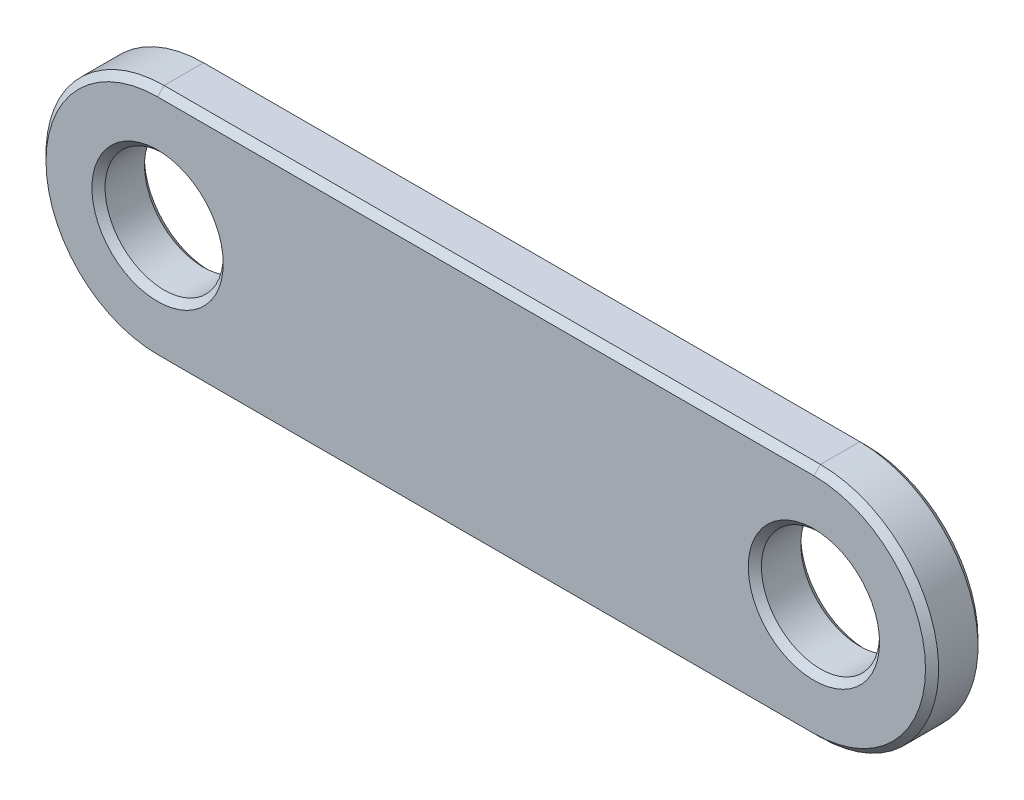
ISO-10303-21;
HEADER;
FILE_DESCRIPTION(('STEP AP214'),'2;1');
FILE_NAME('part.step','',(''),(''),'','','');
FILE_SCHEMA(('AUTOMOTIVE_DESIGN { 1 0 10303 214 1 1 1 1 }'));
ENDSEC;
DATA;
#1=APPLICATION_CONTEXT('core data for automotive mechanical design processes');
#2=APPLICATION_PROTOCOL_DEFINITION('international standard','automotive_design',2000,#1);
#3=PRODUCT_CONTEXT('',#1,'mechanical');
#4=PRODUCT('Part','Part','',(#3));
#5=PRODUCT_RELATED_PRODUCT_CATEGORY('part','',(#4));
#6=PRODUCT_DEFINITION_FORMATION('','',#4);
#7=PRODUCT_DEFINITION_CONTEXT('part definition',#1,'design');
#8=PRODUCT_DEFINITION('design','',#6,#7);
#9=PRODUCT_DEFINITION_SHAPE('','',#8);
#10=(LENGTH_UNIT() NAMED_UNIT(*) SI_UNIT(.MILLI.,.METRE.));
#11=(NAMED_UNIT(*) PLANE_ANGLE_UNIT() SI_UNIT($,.RADIAN.));
#12=(NAMED_UNIT(*) SI_UNIT($,.STERADIAN.) SOLID_ANGLE_UNIT());
#13=UNCERTAINTY_MEASURE_WITH_UNIT(LENGTH_MEASURE(1.E-05),#10,'distance_accuracy_value','');
#14=(GEOMETRIC_REPRESENTATION_CONTEXT(3) GLOBAL_UNCERTAINTY_ASSIGNED_CONTEXT((#13)) GLOBAL_UNIT_ASSIGNED_CONTEXT((#10,
#11,#12)) REPRESENTATION_CONTEXT('',''));
#15=CARTESIAN_POINT('',(0.,0.,0.));
#16=DIRECTION('',(0.,0.,1.));
#17=DIRECTION('',(1.,0.,0.));
#18=AXIS2_PLACEMENT_3D('',#15,#16,#17);
#19=CARTESIAN_POINT('',(-63.5,0.,5.08));
#20=DIRECTION('',(0.,0.,1.));
#21=DIRECTION('',(1.,0.,0.));
#22=AXIS2_PLACEMENT_3D('',#19,#20,#21);
#23=PLANE('',#22);
#24=CARTESIAN_POINT('',(0.,0.,5.08));
#25=DIRECTION('',(0.,0.,1.));
#26=DIRECTION('',(1.,0.,0.));
#27=AXIS2_PLACEMENT_3D('',#24,#25,#26);
#28=CIRCLE('',#27,6.34999999999998);
#29=CARTESIAN_POINT('',(6.34999999999998,0.,5.08));
#30=VERTEX_POINT('',#29);
#31=EDGE_CURVE('E269',#30,#30,#28,.F.);
#32=ORIENTED_EDGE('',*,*,#31,.T.);
#33=EDGE_LOOP('',(#32));
#34=FACE_BOUND('',#33,.T.);
#35=CARTESIAN_POINT('',(-63.5,0.,5.08));
#36=DIRECTION('',(0.,0.,1.));
#37=DIRECTION('',(1.,0.,0.));
#38=AXIS2_PLACEMENT_3D('',#35,#36,#37);
#39=CIRCLE('',#38,6.34999999999998);
#40=CARTESIAN_POINT('',(-57.1500000000001,0.,5.08));
#41=VERTEX_POINT('',#40);
#42=EDGE_CURVE('E254',#41,#41,#39,.F.);
#43=ORIENTED_EDGE('',*,*,#42,.T.);
#44=EDGE_LOOP('',(#43));
#45=FACE_BOUND('',#44,.T.);
#46=CARTESIAN_POINT('',(0.,0.,5.08));
#47=DIRECTION('',(0.,0.,1.));
#48=DIRECTION('',(1.,0.,0.));
#49=AXIS2_PLACEMENT_3D('',#46,#47,#48);
#50=CIRCLE('',#49,10.795);
#51=CARTESIAN_POINT('',(0.,-10.7950000000002,5.08));
#52=VERTEX_POINT('',#51);
#53=CARTESIAN_POINT('',(0.,10.795,5.08));
#54=VERTEX_POINT('',#53);
#55=EDGE_CURVE('E26',#52,#54,#50,.T.);
#56=ORIENTED_EDGE('',*,*,#55,.T.);
#57=DIRECTION('',(-1.,0.,0.));
#58=VECTOR('',#57,1.);
#59=CARTESIAN_POINT('',(-63.5,10.795,5.07999999999998));
#60=LINE('',#59,#58);
#61=CARTESIAN_POINT('',(-63.5,10.795,5.07999999999998));
#62=VERTEX_POINT('',#61);
#63=EDGE_CURVE('E10',#54,#62,#60,.T.);
#64=ORIENTED_EDGE('',*,*,#63,.T.);
#65=CARTESIAN_POINT('',(-63.5,0.,5.08));
#66=DIRECTION('',(0.,0.,1.));
#67=DIRECTION('',(1.,0.,0.));
#68=AXIS2_PLACEMENT_3D('',#65,#66,#67);
#69=CIRCLE('',#68,10.795);
#70=CARTESIAN_POINT('',(-63.5,-10.7950000000001,5.07999999999999));
#71=VERTEX_POINT('',#70);
#72=EDGE_CURVE('E166',#62,#71,#69,.T.);
#73=ORIENTED_EDGE('',*,*,#72,.T.);
#74=DIRECTION('',(1.,0.,0.));
#75=VECTOR('',#74,1.);
#76=CARTESIAN_POINT('',(0.,-10.7950000000002,5.08));
#77=LINE('',#76,#75);
#78=EDGE_CURVE('E44',#71,#52,#77,.T.);
#79=ORIENTED_EDGE('',*,*,#78,.T.);
#80=EDGE_LOOP('',(#56,#64,#73,#79));
#81=FACE_BOUND('',#80,.T.);
#82=ADVANCED_FACE('F16',(#34,#45,#81),#23,.T.);
#83=CARTESIAN_POINT('',(-63.5000000000001,0.,0.));
#84=DIRECTION('',(0.,0.,1.));
#85=DIRECTION('',(1.,0.,0.));
#86=AXIS2_PLACEMENT_3D('',#83,#84,#85);
#87=PLANE('',#86);
#88=CARTESIAN_POINT('',(0.,0.,0.));
#89=DIRECTION('',(0.,0.,1.));
#90=DIRECTION('',(1.,0.,0.));
#91=AXIS2_PLACEMENT_3D('',#88,#89,#90);
#92=CIRCLE('',#91,6.35);
#93=CARTESIAN_POINT('',(6.35,0.,0.));
#94=VERTEX_POINT('',#93);
#95=EDGE_CURVE('E249',#94,#94,#92,.T.);
#96=ORIENTED_EDGE('',*,*,#95,.T.);
#97=EDGE_LOOP('',(#96));
#98=FACE_BOUND('',#97,.T.);
#99=CARTESIAN_POINT('',(-63.5000000000001,0.,0.));
#100=DIRECTION('',(0.,0.,1.));
#101=DIRECTION('',(1.,0.,0.));
#102=AXIS2_PLACEMENT_3D('',#99,#100,#101);
#103=CIRCLE('',#102,6.34999999999999);
#104=CARTESIAN_POINT('',(-57.1500000000001,0.,0.));
#105=VERTEX_POINT('',#104);
#106=EDGE_CURVE('E258',#105,#105,#103,.T.);
#107=ORIENTED_EDGE('',*,*,#106,.T.);
#108=EDGE_LOOP('',(#107));
#109=FACE_BOUND('',#108,.T.);
#110=CARTESIAN_POINT('',(0.,0.,0.));
#111=DIRECTION('',(0.,0.,1.));
#112=DIRECTION('',(1.,0.,0.));
#113=AXIS2_PLACEMENT_3D('',#110,#111,#112);
#114=CIRCLE('',#113,10.795);
#115=CARTESIAN_POINT('',(0.,10.7949999999999,0.));
#116=VERTEX_POINT('',#115);
#117=CARTESIAN_POINT('',(0.,-10.7950000000001,0.));
#118=VERTEX_POINT('',#117);
#119=EDGE_CURVE('E132',#116,#118,#114,.F.);
#120=ORIENTED_EDGE('',*,*,#119,.T.);
#121=DIRECTION('',(-1.,0.,0.));
#122=VECTOR('',#121,1.);
#123=CARTESIAN_POINT('',(-63.5,-10.7950000000001,0.));
#124=LINE('',#123,#122);
#125=CARTESIAN_POINT('',(-63.5,-10.7950000000001,0.));
#126=VERTEX_POINT('',#125);
#127=EDGE_CURVE('E109',#118,#126,#124,.T.);
#128=ORIENTED_EDGE('',*,*,#127,.T.);
#129=CARTESIAN_POINT('',(-63.5000000000001,0.,0.));
#130=DIRECTION('',(0.,0.,1.));
#131=DIRECTION('',(1.,0.,0.));
#132=AXIS2_PLACEMENT_3D('',#129,#130,#131);
#133=CIRCLE('',#132,10.795);
#134=CARTESIAN_POINT('',(-63.5,10.795,0.));
#135=VERTEX_POINT('',#134);
#136=EDGE_CURVE('E120',#126,#135,#133,.F.);
#137=ORIENTED_EDGE('',*,*,#136,.T.);
#138=DIRECTION('',(1.,0.,0.));
#139=VECTOR('',#138,1.);
#140=CARTESIAN_POINT('',(-63.5,10.795,0.));
#141=LINE('',#140,#139);
#142=EDGE_CURVE('E127',#135,#116,#141,.T.);
#143=ORIENTED_EDGE('',*,*,#142,.T.);
#144=EDGE_LOOP('',(#120,#128,#137,#143));
#145=FACE_BOUND('',#144,.T.);
#146=ADVANCED_FACE('F130',(#98,#109,#145),#87,.F.);
#147=CARTESIAN_POINT('',(-63.5,0.,5.08));
#148=DIRECTION('',(0.,0.,-1.));
#149=DIRECTION('',(-1.,0.,0.));
#150=AXIS2_PLACEMENT_3D('',#147,#148,#149);
#151=CYLINDRICAL_SURFACE('',#150,11.43);
#152=DIRECTION('',(0.,0.,-1.));
#153=VECTOR('',#152,1.);
#154=CARTESIAN_POINT('',(-63.5,11.43,5.07999999999999));
#155=LINE('',#154,#153);
#156=CARTESIAN_POINT('',(-63.5,11.43,4.44500000000002));
#157=VERTEX_POINT('',#156);
#158=CARTESIAN_POINT('',(-63.5,11.43,0.635000000000009));
#159=VERTEX_POINT('',#158);
#160=EDGE_CURVE('E180',#157,#159,#155,.T.);
#161=ORIENTED_EDGE('',*,*,#160,.T.);
#162=CARTESIAN_POINT('',(-63.5000000000001,0.,0.635000000000002));
#163=DIRECTION('',(0.,0.,1.));
#164=DIRECTION('',(1.,0.,0.));
#165=AXIS2_PLACEMENT_3D('',#162,#163,#164);
#166=CIRCLE('',#165,11.43);
#167=CARTESIAN_POINT('',(-63.5,-11.4300000000001,0.634999999999995));
#168=VERTEX_POINT('',#167);
#169=EDGE_CURVE('E163',#159,#168,#166,.T.);
#170=ORIENTED_EDGE('',*,*,#169,.T.);
#171=DIRECTION('',(0.,0.,-1.));
#172=VECTOR('',#171,1.);
#173=CARTESIAN_POINT('',(-63.5000000000001,-11.4300000000001,5.08));
#174=LINE('',#173,#172);
#175=CARTESIAN_POINT('',(-63.5,-11.4300000000001,4.44500000000002));
#176=VERTEX_POINT('',#175);
#177=EDGE_CURVE('E128',#176,#168,#174,.T.);
#178=ORIENTED_EDGE('',*,*,#177,.F.);
#179=CARTESIAN_POINT('',(-63.5,0.,4.44500000000002));
#180=DIRECTION('',(0.,0.,1.));
#181=DIRECTION('',(1.,0.,0.));
#182=AXIS2_PLACEMENT_3D('',#179,#180,#181);
#183=CIRCLE('',#182,11.43);
#184=EDGE_CURVE('E160',#176,#157,#183,.F.);
#185=ORIENTED_EDGE('',*,*,#184,.T.);
#186=EDGE_LOOP('',(#161,#170,#178,#185));
#187=FACE_BOUND('',#186,.T.);
#188=ADVANCED_FACE('F215',(#187),#151,.T.);
#189=CARTESIAN_POINT('',(-63.5000000000001,-11.4300000000001,5.08));
#190=DIRECTION('',(0.,1.,0.));
#191=DIRECTION('',(0.,0.,1.));
#192=AXIS2_PLACEMENT_3D('',#189,#190,#191);
#193=PLANE('',#192);
#194=ORIENTED_EDGE('',*,*,#177,.T.);
#195=DIRECTION('',(1.,0.,0.));
#196=VECTOR('',#195,1.);
#197=CARTESIAN_POINT('',(-63.5,-11.4300000000001,0.634999999999995));
#198=LINE('',#197,#196);
#199=CARTESIAN_POINT('',(0.,-11.4300000000001,0.635000000000012));
#200=VERTEX_POINT('',#199);
#201=EDGE_CURVE('E112',#168,#200,#198,.T.);
#202=ORIENTED_EDGE('',*,*,#201,.T.);
#203=DIRECTION('',(0.,0.,-1.));
#204=VECTOR('',#203,1.);
#205=CARTESIAN_POINT('',(0.,-11.4300000000001,5.08000000000001));
#206=LINE('',#205,#204);
#207=CARTESIAN_POINT('',(0.,-11.4300000000001,4.44500000000003));
#208=VERTEX_POINT('',#207);
#209=EDGE_CURVE('E212',#208,#200,#206,.T.);
#210=ORIENTED_EDGE('',*,*,#209,.F.);
#211=DIRECTION('',(-1.,0.,0.));
#212=VECTOR('',#211,1.);
#213=CARTESIAN_POINT('',(-63.5,-11.4300000000001,4.44500000000002));
#214=LINE('',#213,#212);
#215=EDGE_CURVE('E134',#208,#176,#214,.T.);
#216=ORIENTED_EDGE('',*,*,#215,.T.);
#217=EDGE_LOOP('',(#194,#202,#210,#216));
#218=FACE_BOUND('',#217,.T.);
#219=ADVANCED_FACE('F210',(#218),#193,.F.);
#220=CARTESIAN_POINT('',(0.,0.,5.08));
#221=DIRECTION('',(0.,0.,-1.));
#222=DIRECTION('',(-1.,0.,0.));
#223=AXIS2_PLACEMENT_3D('',#220,#221,#222);
#224=CYLINDRICAL_SURFACE('',#223,11.43);
#225=ORIENTED_EDGE('',*,*,#209,.T.);
#226=CARTESIAN_POINT('',(0.,0.,0.635000000000011));
#227=DIRECTION('',(0.,0.,1.));
#228=DIRECTION('',(1.,0.,0.));
#229=AXIS2_PLACEMENT_3D('',#226,#227,#228);
#230=CIRCLE('',#229,11.43);
#231=CARTESIAN_POINT('',(0.,11.43,0.635000000000016));
#232=VERTEX_POINT('',#231);
#233=EDGE_CURVE('E150',#200,#232,#230,.T.);
#234=ORIENTED_EDGE('',*,*,#233,.T.);
#235=DIRECTION('',(0.,0.,-1.));
#236=VECTOR('',#235,1.);
#237=CARTESIAN_POINT('',(0.,11.43,5.08000000000001));
#238=LINE('',#237,#236);
#239=CARTESIAN_POINT('',(0.,11.43,4.44500000000003));
#240=VERTEX_POINT('',#239);
#241=EDGE_CURVE('E221',#240,#232,#238,.T.);
#242=ORIENTED_EDGE('',*,*,#241,.F.);
#243=CARTESIAN_POINT('',(0.,0.,4.44500000000002));
#244=DIRECTION('',(0.,0.,1.));
#245=DIRECTION('',(1.,0.,0.));
#246=AXIS2_PLACEMENT_3D('',#243,#244,#245);
#247=CIRCLE('',#246,11.43);
#248=EDGE_CURVE('E147',#240,#208,#247,.F.);
#249=ORIENTED_EDGE('',*,*,#248,.T.);
#250=EDGE_LOOP('',(#225,#234,#242,#249));
#251=FACE_BOUND('',#250,.T.);
#252=ADVANCED_FACE('F238',(#251),#224,.T.);
#253=CARTESIAN_POINT('',(-63.5,11.43,5.07999999999999));
#254=DIRECTION('',(0.,-1.,0.));
#255=DIRECTION('',(0.,0.,-1.));
#256=AXIS2_PLACEMENT_3D('',#253,#254,#255);
#257=PLANE('',#256);
#258=ORIENTED_EDGE('',*,*,#241,.T.);
#259=DIRECTION('',(-1.,0.,0.));
#260=VECTOR('',#259,1.);
#261=CARTESIAN_POINT('',(-63.5,11.43,0.635000000000009));
#262=LINE('',#261,#260);
#263=EDGE_CURVE('E157',#232,#159,#262,.T.);
#264=ORIENTED_EDGE('',*,*,#263,.T.);
#265=ORIENTED_EDGE('',*,*,#160,.F.);
#266=DIRECTION('',(1.,0.,0.));
#267=VECTOR('',#266,1.);
#268=CARTESIAN_POINT('',(0.,11.43,4.44500000000003));
#269=LINE('',#268,#267);
#270=EDGE_CURVE('E153',#157,#240,#269,.T.);
#271=ORIENTED_EDGE('',*,*,#270,.T.);
#272=EDGE_LOOP('',(#258,#264,#265,#271));
#273=FACE_BOUND('',#272,.T.);
#274=ADVANCED_FACE('F310',(#273),#257,.F.);
#275=CARTESIAN_POINT('',(-63.5,11.43,0.635000000000009));
#276=DIRECTION('',(0.,-0.707106781186555,0.70710678118654));
#277=DIRECTION('',(-1.,0.,0.));
#278=AXIS2_PLACEMENT_3D('',#275,#276,#277);
#279=PLANE('',#278);
#280=DIRECTION('',(0.,0.707106781186542,0.707106781186555));
#281=VECTOR('',#280,1.);
#282=CARTESIAN_POINT('',(0.,10.7949999999999,0.));
#283=LINE('',#282,#281);
#284=EDGE_CURVE('E116',#116,#232,#283,.T.);
#285=ORIENTED_EDGE('',*,*,#284,.F.);
#286=ORIENTED_EDGE('',*,*,#142,.F.);
#287=DIRECTION('',(0.,-0.707106781186542,-0.707106781186555));
#288=VECTOR('',#287,1.);
#289=CARTESIAN_POINT('',(-63.5,11.43,0.635000000000009));
#290=LINE('',#289,#288);
#291=EDGE_CURVE('E123',#159,#135,#290,.T.);
#292=ORIENTED_EDGE('',*,*,#291,.F.);
#293=ORIENTED_EDGE('',*,*,#263,.F.);
#294=EDGE_LOOP('',(#285,#286,#292,#293));
#295=FACE_BOUND('',#294,.T.);
#296=ADVANCED_FACE('F231',(#295),#279,.F.);
#297=CARTESIAN_POINT('',(-63.5000000000001,0.,0.635000000000002));
#298=DIRECTION('',(0.,0.,1.));
#299=DIRECTION('',(1.,0.,0.));
#300=AXIS2_PLACEMENT_3D('',#297,#298,#299);
#301=CONICAL_SURFACE('',#300,11.43,0.785398163397439);
#302=ORIENTED_EDGE('',*,*,#291,.T.);
#303=ORIENTED_EDGE('',*,*,#136,.F.);
#304=DIRECTION('',(0.,0.707106781186541,-0.707106781186554));
#305=VECTOR('',#304,1.);
#306=CARTESIAN_POINT('',(-63.5,-11.4300000000001,0.634999999999995));
#307=LINE('',#306,#305);
#308=EDGE_CURVE('E105',#168,#126,#307,.T.);
#309=ORIENTED_EDGE('',*,*,#308,.F.);
#310=ORIENTED_EDGE('',*,*,#169,.F.);
#311=EDGE_LOOP('',(#302,#303,#309,#310));
#312=FACE_BOUND('',#311,.T.);
#313=ADVANCED_FACE('F121',(#312),#301,.T.);
#314=CARTESIAN_POINT('',(0.,0.,0.635000000000011));
#315=DIRECTION('',(0.,0.,1.));
#316=DIRECTION('',(1.,0.,0.));
#317=AXIS2_PLACEMENT_3D('',#314,#315,#316);
#318=CONICAL_SURFACE('',#317,11.43,0.785398163397439);
#319=ORIENTED_EDGE('',*,*,#284,.T.);
#320=ORIENTED_EDGE('',*,*,#233,.F.);
#321=DIRECTION('',(0.,-0.707106781186541,0.707106781186554));
#322=VECTOR('',#321,1.);
#323=CARTESIAN_POINT('',(0.,-10.7950000000001,0.));
#324=LINE('',#323,#322);
#325=EDGE_CURVE('E117',#118,#200,#324,.T.);
#326=ORIENTED_EDGE('',*,*,#325,.F.);
#327=ORIENTED_EDGE('',*,*,#119,.F.);
#328=EDGE_LOOP('',(#319,#320,#326,#327));
#329=FACE_BOUND('',#328,.T.);
#330=ADVANCED_FACE('F234',(#329),#318,.T.);
#331=CARTESIAN_POINT('',(-63.5,-11.4300000000001,0.634999999999995));
#332=DIRECTION('',(0.,0.707106781186555,0.707106781186541));
#333=DIRECTION('',(1.,0.,0.));
#334=AXIS2_PLACEMENT_3D('',#331,#332,#333);
#335=PLANE('',#334);
#336=ORIENTED_EDGE('',*,*,#308,.T.);
#337=ORIENTED_EDGE('',*,*,#127,.F.);
#338=ORIENTED_EDGE('',*,*,#325,.T.);
#339=ORIENTED_EDGE('',*,*,#201,.F.);
#340=EDGE_LOOP('',(#336,#337,#338,#339));
#341=FACE_BOUND('',#340,.T.);
#342=ADVANCED_FACE('F107',(#341),#335,.F.);
#343=CARTESIAN_POINT('',(-63.5,-10.7950000000001,5.07999999999999));
#344=DIRECTION('',(0.,-0.707106781186543,0.707106781186552));
#345=DIRECTION('',(-1.,0.,0.));
#346=AXIS2_PLACEMENT_3D('',#343,#344,#345);
#347=PLANE('',#346);
#348=DIRECTION('',(0.,0.707106781186553,0.707106781186543));
#349=VECTOR('',#348,1.);
#350=CARTESIAN_POINT('',(-63.5,-11.4300000000001,4.44500000000002));
#351=LINE('',#350,#349);
#352=EDGE_CURVE('E187',#176,#71,#351,.T.);
#353=ORIENTED_EDGE('',*,*,#352,.F.);
#354=ORIENTED_EDGE('',*,*,#215,.F.);
#355=DIRECTION('',(0.,-0.707106781186553,-0.707106781186543));
#356=VECTOR('',#355,1.);
#357=CARTESIAN_POINT('',(0.,-10.7950000000002,5.08));
#358=LINE('',#357,#356);
#359=EDGE_CURVE('E20',#52,#208,#358,.T.);
#360=ORIENTED_EDGE('',*,*,#359,.F.);
#361=ORIENTED_EDGE('',*,*,#78,.F.);
#362=EDGE_LOOP('',(#353,#354,#360,#361));
#363=FACE_BOUND('',#362,.T.);
#364=ADVANCED_FACE('F18',(#363),#347,.T.);
#365=CARTESIAN_POINT('',(0.,0.,5.08));
#366=DIRECTION('',(0.,0.,-1.));
#367=DIRECTION('',(-1.,0.,0.));
#368=AXIS2_PLACEMENT_3D('',#365,#366,#367);
#369=CONICAL_SURFACE('',#368,10.795,0.785398163397455);
#370=ORIENTED_EDGE('',*,*,#359,.T.);
#371=ORIENTED_EDGE('',*,*,#248,.F.);
#372=DIRECTION('',(0.,0.707106781186553,-0.707106781186542));
#373=VECTOR('',#372,1.);
#374=CARTESIAN_POINT('',(0.,10.795,5.08));
#375=LINE('',#374,#373);
#376=EDGE_CURVE('E184',#54,#240,#375,.T.);
#377=ORIENTED_EDGE('',*,*,#376,.F.);
#378=ORIENTED_EDGE('',*,*,#55,.F.);
#379=EDGE_LOOP('',(#370,#371,#377,#378));
#380=FACE_BOUND('',#379,.T.);
#381=ADVANCED_FACE('F203',(#380),#369,.T.);
#382=CARTESIAN_POINT('',(-63.5,0.,5.08));
#383=DIRECTION('',(0.,0.,-1.));
#384=DIRECTION('',(-1.,0.,0.));
#385=AXIS2_PLACEMENT_3D('',#382,#383,#384);
#386=CONICAL_SURFACE('',#385,10.795,0.785398163397455);
#387=ORIENTED_EDGE('',*,*,#352,.T.);
#388=ORIENTED_EDGE('',*,*,#72,.F.);
#389=DIRECTION('',(0.,-0.707106781186553,0.707106781186542));
#390=VECTOR('',#389,1.);
#391=CARTESIAN_POINT('',(-63.5,11.43,4.44500000000002));
#392=LINE('',#391,#390);
#393=EDGE_CURVE('E181',#157,#62,#392,.T.);
#394=ORIENTED_EDGE('',*,*,#393,.F.);
#395=ORIENTED_EDGE('',*,*,#184,.F.);
#396=EDGE_LOOP('',(#387,#388,#394,#395));
#397=FACE_BOUND('',#396,.T.);
#398=ADVANCED_FACE('F330',(#397),#386,.T.);
#399=CARTESIAN_POINT('',(-63.5,10.795,5.07999999999998));
#400=DIRECTION('',(0.,0.707106781186543,0.707106781186553));
#401=DIRECTION('',(1.,0.,0.));
#402=AXIS2_PLACEMENT_3D('',#399,#400,#401);
#403=PLANE('',#402);
#404=ORIENTED_EDGE('',*,*,#376,.T.);
#405=ORIENTED_EDGE('',*,*,#270,.F.);
#406=ORIENTED_EDGE('',*,*,#393,.T.);
#407=ORIENTED_EDGE('',*,*,#63,.F.);
#408=EDGE_LOOP('',(#404,#405,#406,#407));
#409=FACE_BOUND('',#408,.T.);
#410=ADVANCED_FACE('F327',(#409),#403,.T.);
#411=CARTESIAN_POINT('',(-63.5,0.,4.44500000000002));
#412=DIRECTION('',(0.,0.,1.));
#413=DIRECTION('',(1.,0.,0.));
#414=AXIS2_PLACEMENT_3D('',#411,#412,#413);
#415=CONICAL_SURFACE('',#414,5.71500000000001,0.785398163397449);
#416=ORIENTED_EDGE('',*,*,#42,.F.);
#417=EDGE_LOOP('',(#416));
#418=FACE_BOUND('',#417,.T.);
#419=CARTESIAN_POINT('',(-63.5,0.,4.44500000000002));
#420=DIRECTION('',(0.,0.,1.));
#421=DIRECTION('',(1.,0.,0.));
#422=AXIS2_PLACEMENT_3D('',#419,#420,#421);
#423=CIRCLE('',#422,5.71500000000001);
#424=CARTESIAN_POINT('',(-57.785,0.,4.44500000000002));
#425=VERTEX_POINT('',#424);
#426=EDGE_CURVE('E245',#425,#425,#423,.T.);
#427=ORIENTED_EDGE('',*,*,#426,.F.);
#428=EDGE_LOOP('',(#427));
#429=FACE_BOUND('',#428,.T.);
#430=ADVANCED_FACE('F307',(#418,#429),#415,.F.);
#431=CARTESIAN_POINT('',(-63.5000000000001,0.,0.));
#432=DIRECTION('',(0.,0.,-1.));
#433=DIRECTION('',(-1.,0.,0.));
#434=AXIS2_PLACEMENT_3D('',#431,#432,#433);
#435=CONICAL_SURFACE('',#434,6.34999999999999,0.78539816339745);
#436=CARTESIAN_POINT('',(-63.5,0.,0.634999999999988));
#437=DIRECTION('',(0.,0.,1.));
#438=DIRECTION('',(1.,0.,0.));
#439=AXIS2_PLACEMENT_3D('',#436,#437,#438);
#440=CIRCLE('',#439,5.71500000000001);
#441=CARTESIAN_POINT('',(-57.785,0.,0.634999999999988));
#442=VERTEX_POINT('',#441);
#443=EDGE_CURVE('E250',#442,#442,#440,.F.);
#444=ORIENTED_EDGE('',*,*,#443,.F.);
#445=EDGE_LOOP('',(#444));
#446=FACE_BOUND('',#445,.T.);
#447=ORIENTED_EDGE('',*,*,#106,.F.);
#448=EDGE_LOOP('',(#447));
#449=FACE_BOUND('',#448,.T.);
#450=ADVANCED_FACE('F390',(#446,#449),#435,.F.);
#451=CARTESIAN_POINT('',(-63.5,0.,5.08));
#452=DIRECTION('',(0.,0.,-1.));
#453=DIRECTION('',(-1.,0.,0.));
#454=AXIS2_PLACEMENT_3D('',#451,#452,#453);
#455=CYLINDRICAL_SURFACE('',#454,5.71500000000001);
#456=ORIENTED_EDGE('',*,*,#443,.T.);
#457=EDGE_LOOP('',(#456));
#458=FACE_BOUND('',#457,.T.);
#459=ORIENTED_EDGE('',*,*,#426,.T.);
#460=EDGE_LOOP('',(#459));
#461=FACE_BOUND('',#460,.T.);
#462=ADVANCED_FACE('F294',(#458,#461),#455,.F.);
#463=CARTESIAN_POINT('',(0.,0.,4.44500000000002));
#464=DIRECTION('',(0.,0.,1.));
#465=DIRECTION('',(1.,0.,0.));
#466=AXIS2_PLACEMENT_3D('',#463,#464,#465);
#467=CONICAL_SURFACE('',#466,5.715,0.785398163397449);
#468=ORIENTED_EDGE('',*,*,#31,.F.);
#469=EDGE_LOOP('',(#468));
#470=FACE_BOUND('',#469,.T.);
#471=CARTESIAN_POINT('',(0.,0.,4.44500000000002));
#472=DIRECTION('',(0.,0.,1.));
#473=DIRECTION('',(1.,0.,0.));
#474=AXIS2_PLACEMENT_3D('',#471,#472,#473);
#475=CIRCLE('',#474,5.715);
#476=CARTESIAN_POINT('',(5.715,0.,4.44500000000002));
#477=VERTEX_POINT('',#476);
#478=EDGE_CURVE('E185',#477,#477,#475,.T.);
#479=ORIENTED_EDGE('',*,*,#478,.F.);
#480=EDGE_LOOP('',(#479));
#481=FACE_BOUND('',#480,.T.);
#482=ADVANCED_FACE('F284',(#470,#481),#467,.F.);
#483=CARTESIAN_POINT('',(0.,0.,0.));
#484=DIRECTION('',(0.,0.,-1.));
#485=DIRECTION('',(-1.,0.,0.));
#486=AXIS2_PLACEMENT_3D('',#483,#484,#485);
#487=CONICAL_SURFACE('',#486,6.35,0.785398163397442);
#488=CARTESIAN_POINT('',(0.,0.,0.635000000000005));
#489=DIRECTION('',(0.,0.,1.));
#490=DIRECTION('',(1.,0.,0.));
#491=AXIS2_PLACEMENT_3D('',#488,#489,#490);
#492=CIRCLE('',#491,5.715);
#493=CARTESIAN_POINT('',(5.715,0.,0.635000000000006));
#494=VERTEX_POINT('',#493);
#495=EDGE_CURVE('E265',#494,#494,#492,.F.);
#496=ORIENTED_EDGE('',*,*,#495,.F.);
#497=EDGE_LOOP('',(#496));
#498=FACE_BOUND('',#497,.T.);
#499=ORIENTED_EDGE('',*,*,#95,.F.);
#500=EDGE_LOOP('',(#499));
#501=FACE_BOUND('',#500,.T.);
#502=ADVANCED_FACE('F281',(#498,#501),#487,.F.);
#503=CARTESIAN_POINT('',(0.,0.,5.08));
#504=DIRECTION('',(0.,0.,-1.));
#505=DIRECTION('',(-1.,0.,0.));
#506=AXIS2_PLACEMENT_3D('',#503,#504,#505);
#507=CYLINDRICAL_SURFACE('',#506,5.715);
#508=ORIENTED_EDGE('',*,*,#495,.T.);
#509=EDGE_LOOP('',(#508));
#510=FACE_BOUND('',#509,.T.);
#511=ORIENTED_EDGE('',*,*,#478,.T.);
#512=EDGE_LOOP('',(#511));
#513=FACE_BOUND('',#512,.T.);
#514=ADVANCED_FACE('F283',(#510,#513),#507,.F.);
#515=CLOSED_SHELL('',(#82,#146,#188,#219,#252,#274,#296,#313,#330,#342,#364,#381,#398,#410,#430,
#450,#462,#482,#502,#514));
#516=MANIFOLD_SOLID_BREP('B1',#515);
#517=ADVANCED_BREP_SHAPE_REPRESENTATION('',(#18,#516),#14);
#518=SHAPE_DEFINITION_REPRESENTATION(#9,#517);
ENDSEC;
END-ISO-10303-21;
